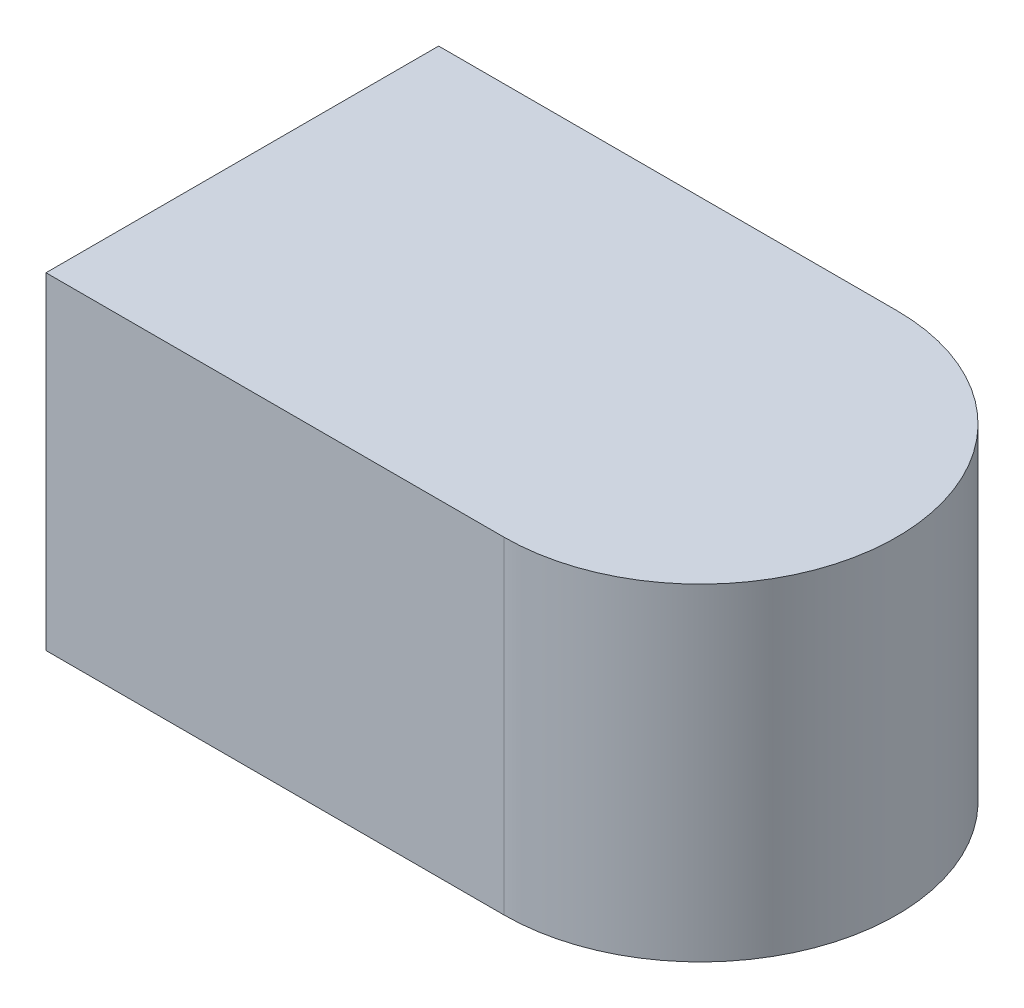
ISO-10303-21;
HEADER;
FILE_DESCRIPTION(('STEP AP214'),'2;1');
FILE_NAME('part.step','',(''),(''),'','','');
FILE_SCHEMA(('AUTOMOTIVE_DESIGN { 1 0 10303 214 1 1 1 1 }'));
ENDSEC;
DATA;
#1=APPLICATION_CONTEXT('core data for automotive mechanical design processes');
#2=APPLICATION_PROTOCOL_DEFINITION('international standard','automotive_design',2000,#1);
#3=PRODUCT_CONTEXT('',#1,'mechanical');
#4=PRODUCT('Part','Part','',(#3));
#5=PRODUCT_RELATED_PRODUCT_CATEGORY('part','',(#4));
#6=PRODUCT_DEFINITION_FORMATION('','',#4);
#7=PRODUCT_DEFINITION_CONTEXT('part definition',#1,'design');
#8=PRODUCT_DEFINITION('design','',#6,#7);
#9=PRODUCT_DEFINITION_SHAPE('','',#8);
#10=(LENGTH_UNIT() NAMED_UNIT(*) SI_UNIT(.MILLI.,.METRE.));
#11=(NAMED_UNIT(*) PLANE_ANGLE_UNIT() SI_UNIT($,.RADIAN.));
#12=(NAMED_UNIT(*) SI_UNIT($,.STERADIAN.) SOLID_ANGLE_UNIT());
#13=UNCERTAINTY_MEASURE_WITH_UNIT(LENGTH_MEASURE(1.E-05),#10,'distance_accuracy_value','');
#14=(GEOMETRIC_REPRESENTATION_CONTEXT(3) GLOBAL_UNCERTAINTY_ASSIGNED_CONTEXT((#13)) GLOBAL_UNIT_ASSIGNED_CONTEXT((#10,
#11,#12)) REPRESENTATION_CONTEXT('',''));
#15=CARTESIAN_POINT('',(0.,0.,0.));
#16=DIRECTION('',(0.,0.,1.));
#17=DIRECTION('',(1.,0.,0.));
#18=AXIS2_PLACEMENT_3D('',#15,#16,#17);
#19=CARTESIAN_POINT('',(0.,0.,0.));
#20=DIRECTION('',(0.,-1.,0.));
#21=DIRECTION('',(-1.,0.,0.));
#22=AXIS2_PLACEMENT_3D('',#19,#20,#21);
#23=PLANE('',#22);
#24=CARTESIAN_POINT('',(-1.47,0.,1.75));
#25=DIRECTION('',(0.,-1.,0.));
#26=DIRECTION('',(0.,0.,-1.));
#27=AXIS2_PLACEMENT_3D('',#24,#25,#26);
#28=CIRCLE('',#27,0.12);
#29=CARTESIAN_POINT('',(-1.47,0.,1.63));
#30=VERTEX_POINT('',#29);
#31=CARTESIAN_POINT('',(-1.47,0.,1.87));
#32=VERTEX_POINT('',#31);
#33=EDGE_CURVE('E11',#30,#32,#28,.T.);
#34=ORIENTED_EDGE('',*,*,#33,.T.);
#35=DIRECTION('',(-1.,0.,0.));
#36=VECTOR('',#35,1.);
#37=CARTESIAN_POINT('',(-1.47,0.,1.87));
#38=LINE('',#37,#36);
#39=CARTESIAN_POINT('',(-1.75,0.,1.87));
#40=VERTEX_POINT('',#39);
#41=EDGE_CURVE('E24',#32,#40,#38,.T.);
#42=ORIENTED_EDGE('',*,*,#41,.T.);
#43=DIRECTION('',(0.,0.,-1.));
#44=VECTOR('',#43,1.);
#45=CARTESIAN_POINT('',(-1.75,0.,1.87));
#46=LINE('',#45,#44);
#47=CARTESIAN_POINT('',(-1.75,0.,1.63));
#48=VERTEX_POINT('',#47);
#49=EDGE_CURVE('E62',#40,#48,#46,.T.);
#50=ORIENTED_EDGE('',*,*,#49,.T.);
#51=DIRECTION('',(1.,0.,0.));
#52=VECTOR('',#51,1.);
#53=CARTESIAN_POINT('',(-1.75,0.,1.63));
#54=LINE('',#53,#52);
#55=EDGE_CURVE('E36',#48,#30,#54,.T.);
#56=ORIENTED_EDGE('',*,*,#55,.T.);
#57=EDGE_LOOP('',(#34,#42,#50,#56));
#58=FACE_BOUND('',#57,.T.);
#59=ADVANCED_FACE('F17',(#58),#23,.T.);
#60=CARTESIAN_POINT('',(-1.75,0.,1.63));
#61=DIRECTION('',(0.,0.,1.));
#62=DIRECTION('',(1.,0.,0.));
#63=AXIS2_PLACEMENT_3D('',#60,#61,#62);
#64=PLANE('',#63);
#65=DIRECTION('',(0.,1.,0.));
#66=VECTOR('',#65,1.);
#67=CARTESIAN_POINT('',(-1.75,0.,1.63));
#68=LINE('',#67,#66);
#69=CARTESIAN_POINT('',(-1.75,0.2,1.63));
#70=VERTEX_POINT('',#69);
#71=EDGE_CURVE('E84',#48,#70,#68,.T.);
#72=ORIENTED_EDGE('',*,*,#71,.T.);
#73=DIRECTION('',(1.,0.,0.));
#74=VECTOR('',#73,1.);
#75=CARTESIAN_POINT('',(-1.75,0.2,1.63));
#76=LINE('',#75,#74);
#77=CARTESIAN_POINT('',(-1.47,0.2,1.63));
#78=VERTEX_POINT('',#77);
#79=EDGE_CURVE('E74',#70,#78,#76,.T.);
#80=ORIENTED_EDGE('',*,*,#79,.T.);
#81=DIRECTION('',(0.,1.,0.));
#82=VECTOR('',#81,1.);
#83=CARTESIAN_POINT('',(-1.47,0.,1.63));
#84=LINE('',#83,#82);
#85=EDGE_CURVE('E81',#30,#78,#84,.T.);
#86=ORIENTED_EDGE('',*,*,#85,.F.);
#87=ORIENTED_EDGE('',*,*,#55,.F.);
#88=EDGE_LOOP('',(#72,#80,#86,#87));
#89=FACE_BOUND('',#88,.T.);
#90=ADVANCED_FACE('F91',(#89),#64,.F.);
#91=CARTESIAN_POINT('',(-1.47,0.,1.75));
#92=DIRECTION('',(0.,-1.,0.));
#93=DIRECTION('',(-1.,0.,0.));
#94=AXIS2_PLACEMENT_3D('',#91,#92,#93);
#95=CYLINDRICAL_SURFACE('',#94,0.12);
#96=ORIENTED_EDGE('',*,*,#85,.T.);
#97=CARTESIAN_POINT('',(-1.47,0.2,1.75));
#98=DIRECTION('',(0.,-1.,0.));
#99=DIRECTION('',(0.,0.,-1.));
#100=AXIS2_PLACEMENT_3D('',#97,#98,#99);
#101=CIRCLE('',#100,0.12);
#102=CARTESIAN_POINT('',(-1.47,0.2,1.87));
#103=VERTEX_POINT('',#102);
#104=EDGE_CURVE('E79',#78,#103,#101,.T.);
#105=ORIENTED_EDGE('',*,*,#104,.T.);
#106=DIRECTION('',(0.,1.,0.));
#107=VECTOR('',#106,1.);
#108=CARTESIAN_POINT('',(-1.47,0.,1.87));
#109=LINE('',#108,#107);
#110=EDGE_CURVE('E68',#32,#103,#109,.T.);
#111=ORIENTED_EDGE('',*,*,#110,.F.);
#112=ORIENTED_EDGE('',*,*,#33,.F.);
#113=EDGE_LOOP('',(#96,#105,#111,#112));
#114=FACE_BOUND('',#113,.T.);
#115=ADVANCED_FACE('F89',(#114),#95,.T.);
#116=CARTESIAN_POINT('',(-1.47,0.,1.87));
#117=DIRECTION('',(0.,0.,-1.));
#118=DIRECTION('',(-1.,0.,0.));
#119=AXIS2_PLACEMENT_3D('',#116,#117,#118);
#120=PLANE('',#119);
#121=ORIENTED_EDGE('',*,*,#110,.T.);
#122=DIRECTION('',(-1.,0.,0.));
#123=VECTOR('',#122,1.);
#124=CARTESIAN_POINT('',(-1.47,0.2,1.87));
#125=LINE('',#124,#123);
#126=CARTESIAN_POINT('',(-1.75,0.2,1.87));
#127=VERTEX_POINT('',#126);
#128=EDGE_CURVE('E63',#103,#127,#125,.T.);
#129=ORIENTED_EDGE('',*,*,#128,.T.);
#130=DIRECTION('',(0.,1.,0.));
#131=VECTOR('',#130,1.);
#132=CARTESIAN_POINT('',(-1.75,0.,1.87));
#133=LINE('',#132,#131);
#134=EDGE_CURVE('E56',#40,#127,#133,.T.);
#135=ORIENTED_EDGE('',*,*,#134,.F.);
#136=ORIENTED_EDGE('',*,*,#41,.F.);
#137=EDGE_LOOP('',(#121,#129,#135,#136));
#138=FACE_BOUND('',#137,.T.);
#139=ADVANCED_FACE('F66',(#138),#120,.F.);
#140=CARTESIAN_POINT('',(-1.75,0.,1.87));
#141=DIRECTION('',(1.,0.,0.));
#142=DIRECTION('',(0.,0.,-1.));
#143=AXIS2_PLACEMENT_3D('',#140,#141,#142);
#144=PLANE('',#143);
#145=ORIENTED_EDGE('',*,*,#134,.T.);
#146=DIRECTION('',(0.,0.,-1.));
#147=VECTOR('',#146,1.);
#148=CARTESIAN_POINT('',(-1.75,0.2,1.87));
#149=LINE('',#148,#147);
#150=EDGE_CURVE('E61',#127,#70,#149,.T.);
#151=ORIENTED_EDGE('',*,*,#150,.T.);
#152=ORIENTED_EDGE('',*,*,#71,.F.);
#153=ORIENTED_EDGE('',*,*,#49,.F.);
#154=EDGE_LOOP('',(#145,#151,#152,#153));
#155=FACE_BOUND('',#154,.T.);
#156=ADVANCED_FACE('F58',(#155),#144,.F.);
#157=CARTESIAN_POINT('',(0.,0.2,0.));
#158=DIRECTION('',(0.,-1.,0.));
#159=DIRECTION('',(-1.,0.,0.));
#160=AXIS2_PLACEMENT_3D('',#157,#158,#159);
#161=PLANE('',#160);
#162=ORIENTED_EDGE('',*,*,#150,.F.);
#163=ORIENTED_EDGE('',*,*,#128,.F.);
#164=ORIENTED_EDGE('',*,*,#104,.F.);
#165=ORIENTED_EDGE('',*,*,#79,.F.);
#166=EDGE_LOOP('',(#162,#163,#164,#165));
#167=FACE_BOUND('',#166,.T.);
#168=ADVANCED_FACE('F72',(#167),#161,.F.);
#169=CLOSED_SHELL('',(#59,#90,#115,#139,#156,#168));
#170=MANIFOLD_SOLID_BREP('B1',#169);
#171=ADVANCED_BREP_SHAPE_REPRESENTATION('',(#18,#170),#14);
#172=SHAPE_DEFINITION_REPRESENTATION(#9,#171);
ENDSEC;
END-ISO-10303-21;
